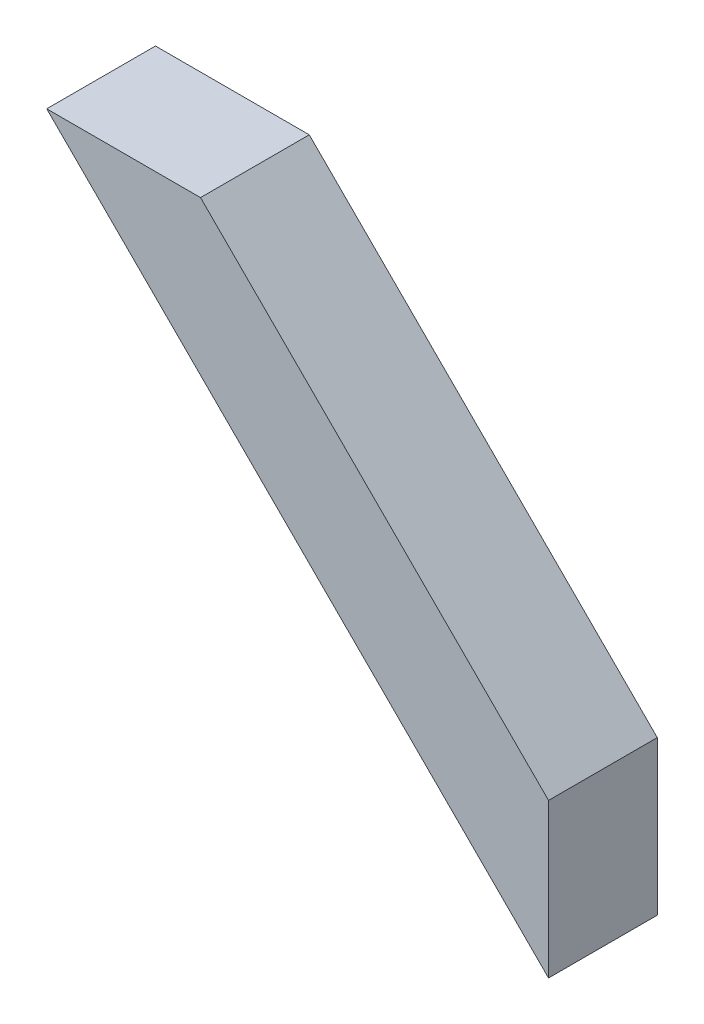
ISO-10303-21;
HEADER;
FILE_DESCRIPTION(('STEP AP214'),'2;1');
FILE_NAME('part.step','',(''),(''),'','','');
FILE_SCHEMA(('AUTOMOTIVE_DESIGN { 1 0 10303 214 1 1 1 1 }'));
ENDSEC;
DATA;
#1=APPLICATION_CONTEXT('core data for automotive mechanical design processes');
#2=APPLICATION_PROTOCOL_DEFINITION('international standard','automotive_design',2000,#1);
#3=PRODUCT_CONTEXT('',#1,'mechanical');
#4=PRODUCT('Part','Part','',(#3));
#5=PRODUCT_RELATED_PRODUCT_CATEGORY('part','',(#4));
#6=PRODUCT_DEFINITION_FORMATION('','',#4);
#7=PRODUCT_DEFINITION_CONTEXT('part definition',#1,'design');
#8=PRODUCT_DEFINITION('design','',#6,#7);
#9=PRODUCT_DEFINITION_SHAPE('','',#8);
#10=(LENGTH_UNIT() NAMED_UNIT(*) SI_UNIT(.MILLI.,.METRE.));
#11=(NAMED_UNIT(*) PLANE_ANGLE_UNIT() SI_UNIT($,.RADIAN.));
#12=(NAMED_UNIT(*) SI_UNIT($,.STERADIAN.) SOLID_ANGLE_UNIT());
#13=UNCERTAINTY_MEASURE_WITH_UNIT(LENGTH_MEASURE(1.E-05),#10,'distance_accuracy_value','');
#14=(GEOMETRIC_REPRESENTATION_CONTEXT(3) GLOBAL_UNCERTAINTY_ASSIGNED_CONTEXT((#13)) GLOBAL_UNIT_ASSIGNED_CONTEXT((#10,
#11,#12)) REPRESENTATION_CONTEXT('',''));
#15=CARTESIAN_POINT('',(0.,0.,0.));
#16=DIRECTION('',(0.,0.,1.));
#17=DIRECTION('',(1.,0.,0.));
#18=AXIS2_PLACEMENT_3D('',#15,#16,#17);
#19=CARTESIAN_POINT('',(0.,0.,63.5));
#20=DIRECTION('',(-1.,0.,0.));
#21=DIRECTION('',(0.,-1.,0.));
#22=AXIS2_PLACEMENT_3D('',#19,#20,#21);
#23=PLANE('',#22);
#24=DIRECTION('',(0.,1.,0.));
#25=VECTOR('',#24,1.);
#26=CARTESIAN_POINT('',(0.,0.,0.));
#27=LINE('',#26,#25);
#28=CARTESIAN_POINT('',(0.,-89.8025612106916,0.));
#29=VERTEX_POINT('',#28);
#30=CARTESIAN_POINT('',(0.,0.,0.));
#31=VERTEX_POINT('',#30);
#32=EDGE_CURVE('E95',#29,#31,#27,.T.);
#33=ORIENTED_EDGE('',*,*,#32,.T.);
#34=DIRECTION('',(0.,0.,-1.));
#35=VECTOR('',#34,1.);
#36=CARTESIAN_POINT('',(0.,0.,63.5));
#37=LINE('',#36,#35);
#38=CARTESIAN_POINT('',(0.,0.,63.5));
#39=VERTEX_POINT('',#38);
#40=EDGE_CURVE('E11',#39,#31,#37,.T.);
#41=ORIENTED_EDGE('',*,*,#40,.F.);
#42=DIRECTION('',(0.,1.,0.));
#43=VECTOR('',#42,1.);
#44=CARTESIAN_POINT('',(0.,0.,63.5));
#45=LINE('',#44,#43);
#46=CARTESIAN_POINT('',(0.,-89.8025612106916,63.5));
#47=VERTEX_POINT('',#46);
#48=EDGE_CURVE('E83',#47,#39,#45,.T.);
#49=ORIENTED_EDGE('',*,*,#48,.F.);
#50=DIRECTION('',(0.,0.,-1.));
#51=VECTOR('',#50,1.);
#52=CARTESIAN_POINT('',(0.,-89.8025612106916,63.5));
#53=LINE('',#52,#51);
#54=EDGE_CURVE('E91',#47,#29,#53,.T.);
#55=ORIENTED_EDGE('',*,*,#54,.T.);
#56=EDGE_LOOP('',(#33,#41,#49,#55));
#57=FACE_BOUND('',#56,.T.);
#58=ADVANCED_FACE('F32',(#57),#23,.F.);
#59=CARTESIAN_POINT('',(-203.2,203.2,63.5));
#60=DIRECTION('',(-0.707106781186547,-0.707106781186548,0.));
#61=DIRECTION('',(0.707106781186548,-0.707106781186547,0.));
#62=AXIS2_PLACEMENT_3D('',#59,#60,#61);
#63=PLANE('',#62);
#64=DIRECTION('',(-0.707106781186548,0.707106781186547,0.));
#65=VECTOR('',#64,1.);
#66=CARTESIAN_POINT('',(-203.2,203.2,0.));
#67=LINE('',#66,#65);
#68=CARTESIAN_POINT('',(-203.2,203.2,0.));
#69=VERTEX_POINT('',#68);
#70=EDGE_CURVE('E87',#31,#69,#67,.T.);
#71=ORIENTED_EDGE('',*,*,#70,.T.);
#72=DIRECTION('',(0.,0.,-1.));
#73=VECTOR('',#72,1.);
#74=CARTESIAN_POINT('',(-203.2,203.2,63.5));
#75=LINE('',#74,#73);
#76=CARTESIAN_POINT('',(-203.2,203.2,63.5));
#77=VERTEX_POINT('',#76);
#78=EDGE_CURVE('E40',#77,#69,#75,.T.);
#79=ORIENTED_EDGE('',*,*,#78,.F.);
#80=DIRECTION('',(-0.707106781186548,0.707106781186547,0.));
#81=VECTOR('',#80,1.);
#82=CARTESIAN_POINT('',(-203.2,203.2,63.5));
#83=LINE('',#82,#81);
#84=EDGE_CURVE('E78',#39,#77,#83,.T.);
#85=ORIENTED_EDGE('',*,*,#84,.F.);
#86=ORIENTED_EDGE('',*,*,#40,.T.);
#87=EDGE_LOOP('',(#71,#79,#85,#86));
#88=FACE_BOUND('',#87,.T.);
#89=ADVANCED_FACE('F86',(#88),#63,.F.);
#90=CARTESIAN_POINT('',(-203.2,203.2,63.5));
#91=DIRECTION('',(0.,-1.,0.));
#92=DIRECTION('',(1.,0.,0.));
#93=AXIS2_PLACEMENT_3D('',#90,#91,#92);
#94=PLANE('',#93);
#95=DIRECTION('',(-1.,0.,0.));
#96=VECTOR('',#95,1.);
#97=CARTESIAN_POINT('',(-203.2,203.2,0.));
#98=LINE('',#97,#96);
#99=CARTESIAN_POINT('',(-293.002561210691,203.2,0.));
#100=VERTEX_POINT('',#99);
#101=EDGE_CURVE('E65',#69,#100,#98,.T.);
#102=ORIENTED_EDGE('',*,*,#101,.T.);
#103=DIRECTION('',(0.,0.,-1.));
#104=VECTOR('',#103,1.);
#105=CARTESIAN_POINT('',(-293.002561210691,203.2,63.5));
#106=LINE('',#105,#104);
#107=CARTESIAN_POINT('',(-293.002561210691,203.2,63.5));
#108=VERTEX_POINT('',#107);
#109=EDGE_CURVE('E88',#108,#100,#106,.T.);
#110=ORIENTED_EDGE('',*,*,#109,.F.);
#111=DIRECTION('',(-1.,0.,0.));
#112=VECTOR('',#111,1.);
#113=CARTESIAN_POINT('',(-203.2,203.2,63.5));
#114=LINE('',#113,#112);
#115=EDGE_CURVE('E81',#77,#108,#114,.T.);
#116=ORIENTED_EDGE('',*,*,#115,.F.);
#117=ORIENTED_EDGE('',*,*,#78,.T.);
#118=EDGE_LOOP('',(#102,#110,#116,#117));
#119=FACE_BOUND('',#118,.T.);
#120=ADVANCED_FACE('F89',(#119),#94,.F.);
#121=CARTESIAN_POINT('',(-293.002561210691,203.2,63.5));
#122=DIRECTION('',(0.707106781186548,0.707106781186547,0.));
#123=DIRECTION('',(-0.707106781186547,0.707106781186548,0.));
#124=AXIS2_PLACEMENT_3D('',#121,#122,#123);
#125=PLANE('',#124);
#126=DIRECTION('',(0.707106781186547,-0.707106781186548,0.));
#127=VECTOR('',#126,1.);
#128=CARTESIAN_POINT('',(-293.002561210691,203.2,0.));
#129=LINE('',#128,#127);
#130=EDGE_CURVE('E71',#100,#29,#129,.T.);
#131=ORIENTED_EDGE('',*,*,#130,.T.);
#132=ORIENTED_EDGE('',*,*,#54,.F.);
#133=DIRECTION('',(0.707106781186547,-0.707106781186548,0.));
#134=VECTOR('',#133,1.);
#135=CARTESIAN_POINT('',(-293.002561210691,203.2,63.5));
#136=LINE('',#135,#134);
#137=EDGE_CURVE('E48',#108,#47,#136,.T.);
#138=ORIENTED_EDGE('',*,*,#137,.F.);
#139=ORIENTED_EDGE('',*,*,#109,.T.);
#140=EDGE_LOOP('',(#131,#132,#138,#139));
#141=FACE_BOUND('',#140,.T.);
#142=ADVANCED_FACE('F102',(#141),#125,.F.);
#143=CARTESIAN_POINT('',(0.,0.,63.5));
#144=DIRECTION('',(0.,0.,-1.));
#145=DIRECTION('',(-1.,0.,0.));
#146=AXIS2_PLACEMENT_3D('',#143,#144,#145);
#147=PLANE('',#146);
#148=ORIENTED_EDGE('',*,*,#48,.T.);
#149=ORIENTED_EDGE('',*,*,#84,.T.);
#150=ORIENTED_EDGE('',*,*,#115,.T.);
#151=ORIENTED_EDGE('',*,*,#137,.T.);
#152=EDGE_LOOP('',(#148,#149,#150,#151));
#153=FACE_BOUND('',#152,.T.);
#154=ADVANCED_FACE('F79',(#153),#147,.F.);
#155=CARTESIAN_POINT('',(0.,0.,0.));
#156=DIRECTION('',(0.,0.,-1.));
#157=DIRECTION('',(-1.,0.,0.));
#158=AXIS2_PLACEMENT_3D('',#155,#156,#157);
#159=PLANE('',#158);
#160=ORIENTED_EDGE('',*,*,#32,.F.);
#161=ORIENTED_EDGE('',*,*,#130,.F.);
#162=ORIENTED_EDGE('',*,*,#101,.F.);
#163=ORIENTED_EDGE('',*,*,#70,.F.);
#164=EDGE_LOOP('',(#160,#161,#162,#163));
#165=FACE_BOUND('',#164,.T.);
#166=ADVANCED_FACE('F105',(#165),#159,.T.);
#167=CLOSED_SHELL('',(#58,#89,#120,#142,#154,#166));
#168=MANIFOLD_SOLID_BREP('B2',#167);
#169=ADVANCED_BREP_SHAPE_REPRESENTATION('',(#18,#168),#14);
#170=SHAPE_DEFINITION_REPRESENTATION(#9,#169);
ENDSEC;
END-ISO-10303-21;
